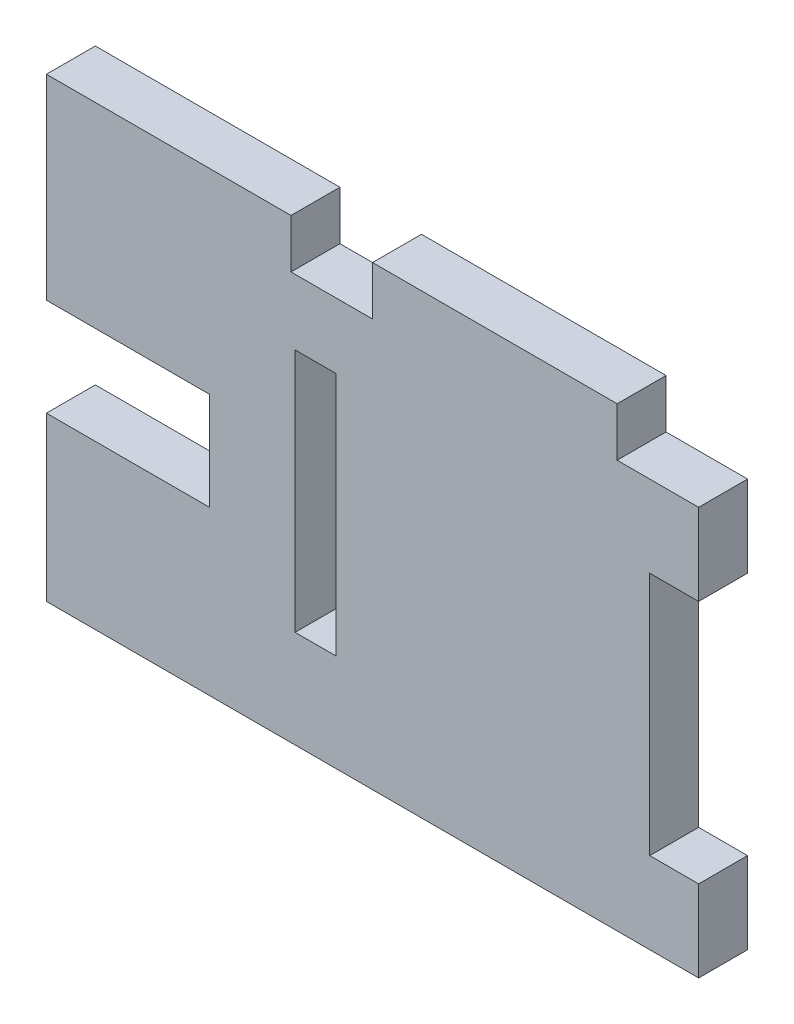
ISO-10303-21;
HEADER;
FILE_DESCRIPTION(('STEP AP214'),'2;1');
FILE_NAME('part.step','',(''),(''),'','','');
FILE_SCHEMA(('AUTOMOTIVE_DESIGN { 1 0 10303 214 1 1 1 1 }'));
ENDSEC;
DATA;
#1=APPLICATION_CONTEXT('core data for automotive mechanical design processes');
#2=APPLICATION_PROTOCOL_DEFINITION('international standard','automotive_design',2000,#1);
#3=PRODUCT_CONTEXT('',#1,'mechanical');
#4=PRODUCT('Part','Part','',(#3));
#5=PRODUCT_RELATED_PRODUCT_CATEGORY('part','',(#4));
#6=PRODUCT_DEFINITION_FORMATION('','',#4);
#7=PRODUCT_DEFINITION_CONTEXT('part definition',#1,'design');
#8=PRODUCT_DEFINITION('design','',#6,#7);
#9=PRODUCT_DEFINITION_SHAPE('','',#8);
#10=(LENGTH_UNIT() NAMED_UNIT(*) SI_UNIT(.MILLI.,.METRE.));
#11=(NAMED_UNIT(*) PLANE_ANGLE_UNIT() SI_UNIT($,.RADIAN.));
#12=(NAMED_UNIT(*) SI_UNIT($,.STERADIAN.) SOLID_ANGLE_UNIT());
#13=UNCERTAINTY_MEASURE_WITH_UNIT(LENGTH_MEASURE(1.E-05),#10,'distance_accuracy_value','');
#14=(GEOMETRIC_REPRESENTATION_CONTEXT(3) GLOBAL_UNCERTAINTY_ASSIGNED_CONTEXT((#13)) GLOBAL_UNIT_ASSIGNED_CONTEXT((#10,
#11,#12)) REPRESENTATION_CONTEXT('',''));
#15=CARTESIAN_POINT('',(0.,0.,0.));
#16=DIRECTION('',(0.,0.,1.));
#17=DIRECTION('',(1.,0.,0.));
#18=AXIS2_PLACEMENT_3D('',#15,#16,#17);
#19=CARTESIAN_POINT('',(-2.07380645161294,0.,3.));
#20=DIRECTION('',(-1.,0.,0.));
#21=DIRECTION('',(0.,0.,1.));
#22=AXIS2_PLACEMENT_3D('',#19,#20,#21);
#23=PLANE('',#22);
#24=DIRECTION('',(0.,1.,0.));
#25=VECTOR('',#24,1.);
#26=CARTESIAN_POINT('',(-2.07380645161294,0.,0.));
#27=LINE('',#26,#25);
#28=CARTESIAN_POINT('',(-2.07380645161294,7.86290322580648,0.));
#29=VERTEX_POINT('',#28);
#30=CARTESIAN_POINT('',(-2.07380645161294,10.8629032258065,0.));
#31=VERTEX_POINT('',#30);
#32=EDGE_CURVE('E237',#29,#31,#27,.T.);
#33=ORIENTED_EDGE('',*,*,#32,.F.);
#34=DIRECTION('',(0.,0.,-1.));
#35=VECTOR('',#34,1.);
#36=CARTESIAN_POINT('',(-2.07380645161294,7.86290322580648,3.));
#37=LINE('',#36,#35);
#38=CARTESIAN_POINT('',(-2.07380645161294,7.86290322580648,3.));
#39=VERTEX_POINT('',#38);
#40=EDGE_CURVE('E11',#39,#29,#37,.T.);
#41=ORIENTED_EDGE('',*,*,#40,.F.);
#42=DIRECTION('',(0.,1.,0.));
#43=VECTOR('',#42,1.);
#44=CARTESIAN_POINT('',(-2.07380645161294,0.,3.));
#45=LINE('',#44,#43);
#46=CARTESIAN_POINT('',(-2.07380645161294,10.8629032258065,3.));
#47=VERTEX_POINT('',#46);
#48=EDGE_CURVE('E345',#39,#47,#45,.T.);
#49=ORIENTED_EDGE('',*,*,#48,.T.);
#50=DIRECTION('',(0.,0.,-1.));
#51=VECTOR('',#50,1.);
#52=CARTESIAN_POINT('',(-2.07380645161294,10.8629032258065,3.));
#53=LINE('',#52,#51);
#54=EDGE_CURVE('E62',#47,#31,#53,.T.);
#55=ORIENTED_EDGE('',*,*,#54,.T.);
#56=EDGE_LOOP('',(#33,#41,#49,#55));
#57=FACE_BOUND('',#56,.T.);
#58=ADVANCED_FACE('F36',(#57),#23,.T.);
#59=CARTESIAN_POINT('',(0.,7.86290322580648,3.));
#60=DIRECTION('',(0.,-1.,0.));
#61=DIRECTION('',(1.,0.,0.));
#62=AXIS2_PLACEMENT_3D('',#59,#60,#61);
#63=PLANE('',#62);
#64=DIRECTION('',(-1.,0.,0.));
#65=VECTOR('',#64,1.);
#66=CARTESIAN_POINT('',(0.,7.86290322580648,0.));
#67=LINE('',#66,#65);
#68=CARTESIAN_POINT('',(-7.07380645161294,7.86290322580648,0.));
#69=VERTEX_POINT('',#68);
#70=EDGE_CURVE('E239',#29,#69,#67,.T.);
#71=ORIENTED_EDGE('',*,*,#70,.T.);
#72=DIRECTION('',(0.,0.,-1.));
#73=VECTOR('',#72,1.);
#74=CARTESIAN_POINT('',(-7.07380645161294,7.86290322580648,3.));
#75=LINE('',#74,#73);
#76=CARTESIAN_POINT('',(-7.07380645161294,7.86290322580648,3.));
#77=VERTEX_POINT('',#76);
#78=EDGE_CURVE('E45',#77,#69,#75,.T.);
#79=ORIENTED_EDGE('',*,*,#78,.F.);
#80=DIRECTION('',(-1.,0.,0.));
#81=VECTOR('',#80,1.);
#82=CARTESIAN_POINT('',(0.,7.86290322580648,3.));
#83=LINE('',#82,#81);
#84=EDGE_CURVE('E347',#39,#77,#83,.T.);
#85=ORIENTED_EDGE('',*,*,#84,.F.);
#86=ORIENTED_EDGE('',*,*,#40,.T.);
#87=EDGE_LOOP('',(#71,#79,#85,#86));
#88=FACE_BOUND('',#87,.T.);
#89=ADVANCED_FACE('F382',(#88),#63,.F.);
#90=CARTESIAN_POINT('',(-7.07380645161294,0.,3.));
#91=DIRECTION('',(1.,0.,0.));
#92=DIRECTION('',(0.,0.,-1.));
#93=AXIS2_PLACEMENT_3D('',#90,#91,#92);
#94=PLANE('',#93);
#95=DIRECTION('',(0.,-1.,0.));
#96=VECTOR('',#95,1.);
#97=CARTESIAN_POINT('',(-7.07380645161294,0.,0.));
#98=LINE('',#97,#96);
#99=CARTESIAN_POINT('',(-7.07380645161294,10.8629032258065,0.));
#100=VERTEX_POINT('',#99);
#101=EDGE_CURVE('E242',#100,#69,#98,.T.);
#102=ORIENTED_EDGE('',*,*,#101,.F.);
#103=DIRECTION('',(0.,0.,-1.));
#104=VECTOR('',#103,1.);
#105=CARTESIAN_POINT('',(-7.07380645161294,10.8629032258065,3.));
#106=LINE('',#105,#104);
#107=CARTESIAN_POINT('',(-7.07380645161294,10.8629032258065,3.));
#108=VERTEX_POINT('',#107);
#109=EDGE_CURVE('E289',#108,#100,#106,.T.);
#110=ORIENTED_EDGE('',*,*,#109,.F.);
#111=DIRECTION('',(0.,-1.,0.));
#112=VECTOR('',#111,1.);
#113=CARTESIAN_POINT('',(-7.07380645161294,0.,3.));
#114=LINE('',#113,#112);
#115=EDGE_CURVE('E349',#108,#77,#114,.T.);
#116=ORIENTED_EDGE('',*,*,#115,.T.);
#117=ORIENTED_EDGE('',*,*,#78,.T.);
#118=EDGE_LOOP('',(#102,#110,#116,#117));
#119=FACE_BOUND('',#118,.T.);
#120=ADVANCED_FACE('F385',(#119),#94,.T.);
#121=CARTESIAN_POINT('',(0.,10.8629032258065,3.));
#122=DIRECTION('',(0.,1.,0.));
#123=DIRECTION('',(0.,0.,1.));
#124=AXIS2_PLACEMENT_3D('',#121,#122,#123);
#125=PLANE('',#124);
#126=DIRECTION('',(1.,0.,0.));
#127=VECTOR('',#126,1.);
#128=CARTESIAN_POINT('',(0.,10.8629032258065,0.));
#129=LINE('',#128,#127);
#130=CARTESIAN_POINT('',(-22.0738064516129,10.8629032258065,0.));
#131=VERTEX_POINT('',#130);
#132=EDGE_CURVE('E245',#131,#100,#129,.T.);
#133=ORIENTED_EDGE('',*,*,#132,.F.);
#134=DIRECTION('',(0.,0.,-1.));
#135=VECTOR('',#134,1.);
#136=CARTESIAN_POINT('',(-22.0738064516129,10.8629032258065,3.));
#137=LINE('',#136,#135);
#138=CARTESIAN_POINT('',(-22.0738064516129,10.8629032258065,3.));
#139=VERTEX_POINT('',#138);
#140=EDGE_CURVE('E287',#139,#131,#137,.T.);
#141=ORIENTED_EDGE('',*,*,#140,.F.);
#142=DIRECTION('',(1.,0.,0.));
#143=VECTOR('',#142,1.);
#144=CARTESIAN_POINT('',(0.,10.8629032258065,3.));
#145=LINE('',#144,#143);
#146=EDGE_CURVE('E352',#139,#108,#145,.T.);
#147=ORIENTED_EDGE('',*,*,#146,.T.);
#148=ORIENTED_EDGE('',*,*,#109,.T.);
#149=EDGE_LOOP('',(#133,#141,#147,#148));
#150=FACE_BOUND('',#149,.T.);
#151=ADVANCED_FACE('F389',(#150),#125,.T.);
#152=CARTESIAN_POINT('',(-22.0738064516129,0.,3.));
#153=DIRECTION('',(-1.,0.,0.));
#154=DIRECTION('',(0.,0.,1.));
#155=AXIS2_PLACEMENT_3D('',#152,#153,#154);
#156=PLANE('',#155);
#157=DIRECTION('',(0.,1.,0.));
#158=VECTOR('',#157,1.);
#159=CARTESIAN_POINT('',(-22.0738064516129,0.,0.));
#160=LINE('',#159,#158);
#161=CARTESIAN_POINT('',(-22.0738064516129,-1.13709677419353,0.));
#162=VERTEX_POINT('',#161);
#163=EDGE_CURVE('E248',#162,#131,#160,.T.);
#164=ORIENTED_EDGE('',*,*,#163,.F.);
#165=DIRECTION('',(0.,0.,-1.));
#166=VECTOR('',#165,1.);
#167=CARTESIAN_POINT('',(-22.0738064516129,-1.13709677419353,3.));
#168=LINE('',#167,#166);
#169=CARTESIAN_POINT('',(-22.0738064516129,-1.13709677419353,3.));
#170=VERTEX_POINT('',#169);
#171=EDGE_CURVE('E220',#170,#162,#168,.T.);
#172=ORIENTED_EDGE('',*,*,#171,.F.);
#173=DIRECTION('',(0.,1.,0.));
#174=VECTOR('',#173,1.);
#175=CARTESIAN_POINT('',(-22.0738064516129,0.,3.));
#176=LINE('',#175,#174);
#177=EDGE_CURVE('E355',#170,#139,#176,.T.);
#178=ORIENTED_EDGE('',*,*,#177,.T.);
#179=ORIENTED_EDGE('',*,*,#140,.T.);
#180=EDGE_LOOP('',(#164,#172,#178,#179));
#181=FACE_BOUND('',#180,.T.);
#182=ADVANCED_FACE('F392',(#181),#156,.T.);
#183=CARTESIAN_POINT('',(0.,-17.1370967741935,3.));
#184=DIRECTION('',(0.,-1.,0.));
#185=DIRECTION('',(1.,0.,0.));
#186=AXIS2_PLACEMENT_3D('',#183,#184,#185);
#187=PLANE('',#186);
#188=DIRECTION('',(0.,0.,1.));
#189=VECTOR('',#188,1.);
#190=CARTESIAN_POINT('',(-22.0738064516129,-17.1370967741935,0.));
#191=LINE('',#190,#189);
#192=CARTESIAN_POINT('',(-22.0738064516129,-17.1370967741935,0.));
#193=VERTEX_POINT('',#192);
#194=CARTESIAN_POINT('',(-22.0738064516129,-17.1370967741935,3.));
#195=VERTEX_POINT('',#194);
#196=EDGE_CURVE('E324',#193,#195,#191,.T.);
#197=ORIENTED_EDGE('',*,*,#196,.F.);
#198=DIRECTION('',(-1.,0.,0.));
#199=VECTOR('',#198,1.);
#200=CARTESIAN_POINT('',(0.,-17.1370967741935,0.));
#201=LINE('',#200,#199);
#202=CARTESIAN_POINT('',(17.9261935483871,-17.1370967741935,0.));
#203=VERTEX_POINT('',#202);
#204=EDGE_CURVE('E251',#203,#193,#201,.T.);
#205=ORIENTED_EDGE('',*,*,#204,.F.);
#206=DIRECTION('',(0.,0.,-1.));
#207=VECTOR('',#206,1.);
#208=CARTESIAN_POINT('',(17.9261935483871,-17.1370967741935,3.));
#209=LINE('',#208,#207);
#210=CARTESIAN_POINT('',(17.9261935483871,-17.1370967741935,3.));
#211=VERTEX_POINT('',#210);
#212=EDGE_CURVE('E285',#211,#203,#209,.T.);
#213=ORIENTED_EDGE('',*,*,#212,.F.);
#214=DIRECTION('',(-1.,0.,0.));
#215=VECTOR('',#214,1.);
#216=CARTESIAN_POINT('',(0.,-17.1370967741935,3.));
#217=LINE('',#216,#215);
#218=EDGE_CURVE('E358',#211,#195,#217,.T.);
#219=ORIENTED_EDGE('',*,*,#218,.T.);
#220=EDGE_LOOP('',(#197,#205,#213,#219));
#221=FACE_BOUND('',#220,.T.);
#222=ADVANCED_FACE('F401',(#221),#187,.T.);
#223=CARTESIAN_POINT('',(17.9261935483871,0.,3.));
#224=DIRECTION('',(1.,0.,0.));
#225=DIRECTION('',(0.,0.,-1.));
#226=AXIS2_PLACEMENT_3D('',#223,#224,#225);
#227=PLANE('',#226);
#228=DIRECTION('',(0.,-1.,0.));
#229=VECTOR('',#228,1.);
#230=CARTESIAN_POINT('',(17.9261935483871,0.,0.));
#231=LINE('',#230,#229);
#232=CARTESIAN_POINT('',(17.9261935483871,-12.1370967741935,0.));
#233=VERTEX_POINT('',#232);
#234=EDGE_CURVE('E254',#233,#203,#231,.T.);
#235=ORIENTED_EDGE('',*,*,#234,.F.);
#236=DIRECTION('',(0.,0.,-1.));
#237=VECTOR('',#236,1.);
#238=CARTESIAN_POINT('',(17.9261935483871,-12.1370967741935,3.));
#239=LINE('',#238,#237);
#240=CARTESIAN_POINT('',(17.9261935483871,-12.1370967741935,3.));
#241=VERTEX_POINT('',#240);
#242=EDGE_CURVE('E283',#241,#233,#239,.T.);
#243=ORIENTED_EDGE('',*,*,#242,.F.);
#244=DIRECTION('',(0.,-1.,0.));
#245=VECTOR('',#244,1.);
#246=CARTESIAN_POINT('',(17.9261935483871,0.,3.));
#247=LINE('',#246,#245);
#248=EDGE_CURVE('E360',#241,#211,#247,.T.);
#249=ORIENTED_EDGE('',*,*,#248,.T.);
#250=ORIENTED_EDGE('',*,*,#212,.T.);
#251=EDGE_LOOP('',(#235,#243,#249,#250));
#252=FACE_BOUND('',#251,.T.);
#253=ADVANCED_FACE('F406',(#252),#227,.T.);
#254=CARTESIAN_POINT('',(0.,-12.1370967741935,3.));
#255=DIRECTION('',(0.,-1.,0.));
#256=DIRECTION('',(1.,0.,0.));
#257=AXIS2_PLACEMENT_3D('',#254,#255,#256);
#258=PLANE('',#257);
#259=DIRECTION('',(-1.,0.,0.));
#260=VECTOR('',#259,1.);
#261=CARTESIAN_POINT('',(0.,-12.1370967741935,0.));
#262=LINE('',#261,#260);
#263=CARTESIAN_POINT('',(14.9261935483871,-12.1370967741935,0.));
#264=VERTEX_POINT('',#263);
#265=EDGE_CURVE('E257',#233,#264,#262,.T.);
#266=ORIENTED_EDGE('',*,*,#265,.T.);
#267=DIRECTION('',(0.,0.,-1.));
#268=VECTOR('',#267,1.);
#269=CARTESIAN_POINT('',(14.9261935483871,-12.1370967741935,3.));
#270=LINE('',#269,#268);
#271=CARTESIAN_POINT('',(14.9261935483871,-12.1370967741935,3.));
#272=VERTEX_POINT('',#271);
#273=EDGE_CURVE('E281',#272,#264,#270,.T.);
#274=ORIENTED_EDGE('',*,*,#273,.F.);
#275=DIRECTION('',(-1.,0.,0.));
#276=VECTOR('',#275,1.);
#277=CARTESIAN_POINT('',(0.,-12.1370967741935,3.));
#278=LINE('',#277,#276);
#279=EDGE_CURVE('E363',#241,#272,#278,.T.);
#280=ORIENTED_EDGE('',*,*,#279,.F.);
#281=ORIENTED_EDGE('',*,*,#242,.T.);
#282=EDGE_LOOP('',(#266,#274,#280,#281));
#283=FACE_BOUND('',#282,.T.);
#284=ADVANCED_FACE('F412',(#283),#258,.F.);
#285=CARTESIAN_POINT('',(14.9261935483871,0.,3.));
#286=DIRECTION('',(1.,0.,0.));
#287=DIRECTION('',(0.,1.,0.));
#288=AXIS2_PLACEMENT_3D('',#285,#286,#287);
#289=PLANE('',#288);
#290=DIRECTION('',(0.,-1.,0.));
#291=VECTOR('',#290,1.);
#292=CARTESIAN_POINT('',(14.9261935483871,0.,0.));
#293=LINE('',#292,#291);
#294=CARTESIAN_POINT('',(14.9261935483871,2.86290322580648,0.));
#295=VERTEX_POINT('',#294);
#296=EDGE_CURVE('E261',#295,#264,#293,.T.);
#297=ORIENTED_EDGE('',*,*,#296,.F.);
#298=DIRECTION('',(0.,0.,-1.));
#299=VECTOR('',#298,1.);
#300=CARTESIAN_POINT('',(14.9261935483871,2.86290322580648,3.));
#301=LINE('',#300,#299);
#302=CARTESIAN_POINT('',(14.9261935483871,2.86290322580648,3.));
#303=VERTEX_POINT('',#302);
#304=EDGE_CURVE('E279',#303,#295,#301,.T.);
#305=ORIENTED_EDGE('',*,*,#304,.F.);
#306=DIRECTION('',(0.,-1.,0.));
#307=VECTOR('',#306,1.);
#308=CARTESIAN_POINT('',(14.9261935483871,0.,3.));
#309=LINE('',#308,#307);
#310=EDGE_CURVE('E365',#303,#272,#309,.T.);
#311=ORIENTED_EDGE('',*,*,#310,.T.);
#312=ORIENTED_EDGE('',*,*,#273,.T.);
#313=EDGE_LOOP('',(#297,#305,#311,#312));
#314=FACE_BOUND('',#313,.T.);
#315=ADVANCED_FACE('F415',(#314),#289,.T.);
#316=CARTESIAN_POINT('',(0.,2.86290322580648,3.));
#317=DIRECTION('',(0.,-1.,0.));
#318=DIRECTION('',(1.,0.,0.));
#319=AXIS2_PLACEMENT_3D('',#316,#317,#318);
#320=PLANE('',#319);
#321=DIRECTION('',(-1.,0.,0.));
#322=VECTOR('',#321,1.);
#323=CARTESIAN_POINT('',(0.,2.86290322580648,0.));
#324=LINE('',#323,#322);
#325=CARTESIAN_POINT('',(17.9261935483871,2.86290322580648,0.));
#326=VERTEX_POINT('',#325);
#327=EDGE_CURVE('E264',#326,#295,#324,.T.);
#328=ORIENTED_EDGE('',*,*,#327,.F.);
#329=DIRECTION('',(0.,0.,-1.));
#330=VECTOR('',#329,1.);
#331=CARTESIAN_POINT('',(17.9261935483871,2.86290322580648,3.));
#332=LINE('',#331,#330);
#333=CARTESIAN_POINT('',(17.9261935483871,2.86290322580648,3.));
#334=VERTEX_POINT('',#333);
#335=EDGE_CURVE('E277',#334,#326,#332,.T.);
#336=ORIENTED_EDGE('',*,*,#335,.F.);
#337=DIRECTION('',(-1.,0.,0.));
#338=VECTOR('',#337,1.);
#339=CARTESIAN_POINT('',(0.,2.86290322580648,3.));
#340=LINE('',#339,#338);
#341=EDGE_CURVE('E367',#334,#303,#340,.T.);
#342=ORIENTED_EDGE('',*,*,#341,.T.);
#343=ORIENTED_EDGE('',*,*,#304,.T.);
#344=EDGE_LOOP('',(#328,#336,#342,#343));
#345=FACE_BOUND('',#344,.T.);
#346=ADVANCED_FACE('F416',(#345),#320,.T.);
#347=CARTESIAN_POINT('',(17.9261935483871,7.86290322580648,0.));
#348=VERTEX_POINT('',#347);
#349=EDGE_CURVE('E258',#348,#326,#231,.T.);
#350=ORIENTED_EDGE('',*,*,#349,.F.);
#351=DIRECTION('',(0.,0.,-1.));
#352=VECTOR('',#351,1.);
#353=CARTESIAN_POINT('',(17.9261935483871,7.86290322580648,3.));
#354=LINE('',#353,#352);
#355=CARTESIAN_POINT('',(17.9261935483871,7.86290322580648,3.));
#356=VERTEX_POINT('',#355);
#357=EDGE_CURVE('E207',#356,#348,#354,.T.);
#358=ORIENTED_EDGE('',*,*,#357,.F.);
#359=EDGE_CURVE('E196',#356,#334,#247,.T.);
#360=ORIENTED_EDGE('',*,*,#359,.T.);
#361=ORIENTED_EDGE('',*,*,#335,.T.);
#362=EDGE_LOOP('',(#350,#358,#360,#361));
#363=FACE_BOUND('',#362,.T.);
#364=ADVANCED_FACE('F372',(#363),#227,.T.);
#365=CARTESIAN_POINT('',(0.,7.86290322580648,3.));
#366=DIRECTION('',(0.,-1.,0.));
#367=DIRECTION('',(0.,0.,-1.));
#368=AXIS2_PLACEMENT_3D('',#365,#366,#367);
#369=PLANE('',#368);
#370=DIRECTION('',(-1.,0.,0.));
#371=VECTOR('',#370,1.);
#372=CARTESIAN_POINT('',(0.,7.86290322580648,0.));
#373=LINE('',#372,#371);
#374=CARTESIAN_POINT('',(12.9261935483871,7.86290322580648,0.));
#375=VERTEX_POINT('',#374);
#376=EDGE_CURVE('E203',#348,#375,#373,.T.);
#377=ORIENTED_EDGE('',*,*,#376,.T.);
#378=DIRECTION('',(0.,0.,-1.));
#379=VECTOR('',#378,1.);
#380=CARTESIAN_POINT('',(12.9261935483871,7.86290322580648,3.));
#381=LINE('',#380,#379);
#382=CARTESIAN_POINT('',(12.9261935483871,7.86290322580648,3.));
#383=VERTEX_POINT('',#382);
#384=EDGE_CURVE('E200',#383,#375,#381,.T.);
#385=ORIENTED_EDGE('',*,*,#384,.F.);
#386=DIRECTION('',(-1.,0.,0.));
#387=VECTOR('',#386,1.);
#388=CARTESIAN_POINT('',(0.,7.86290322580648,3.));
#389=LINE('',#388,#387);
#390=EDGE_CURVE('E186',#356,#383,#389,.T.);
#391=ORIENTED_EDGE('',*,*,#390,.F.);
#392=ORIENTED_EDGE('',*,*,#357,.T.);
#393=EDGE_LOOP('',(#377,#385,#391,#392));
#394=FACE_BOUND('',#393,.T.);
#395=ADVANCED_FACE('F201',(#394),#369,.F.);
#396=CARTESIAN_POINT('',(12.9261935483871,0.,3.));
#397=DIRECTION('',(1.,0.,0.));
#398=DIRECTION('',(0.,1.,0.));
#399=AXIS2_PLACEMENT_3D('',#396,#397,#398);
#400=PLANE('',#399);
#401=DIRECTION('',(0.,-1.,0.));
#402=VECTOR('',#401,1.);
#403=CARTESIAN_POINT('',(12.9261935483871,0.,0.));
#404=LINE('',#403,#402);
#405=CARTESIAN_POINT('',(12.9261935483871,10.8629032258065,0.));
#406=VERTEX_POINT('',#405);
#407=EDGE_CURVE('E268',#406,#375,#404,.T.);
#408=ORIENTED_EDGE('',*,*,#407,.F.);
#409=DIRECTION('',(0.,0.,-1.));
#410=VECTOR('',#409,1.);
#411=CARTESIAN_POINT('',(12.9261935483871,10.8629032258065,3.));
#412=LINE('',#411,#410);
#413=CARTESIAN_POINT('',(12.9261935483871,10.8629032258065,3.));
#414=VERTEX_POINT('',#413);
#415=EDGE_CURVE('E208',#414,#406,#412,.T.);
#416=ORIENTED_EDGE('',*,*,#415,.F.);
#417=DIRECTION('',(0.,-1.,0.));
#418=VECTOR('',#417,1.);
#419=CARTESIAN_POINT('',(12.9261935483871,0.,3.));
#420=LINE('',#419,#418);
#421=EDGE_CURVE('E193',#414,#383,#420,.T.);
#422=ORIENTED_EDGE('',*,*,#421,.T.);
#423=ORIENTED_EDGE('',*,*,#384,.T.);
#424=EDGE_LOOP('',(#408,#416,#422,#423));
#425=FACE_BOUND('',#424,.T.);
#426=ADVANCED_FACE('F210',(#425),#400,.T.);
#427=CARTESIAN_POINT('',(0.,-11.1532258064516,3.));
#428=DIRECTION('',(0.,-1.,0.));
#429=DIRECTION('',(1.,0.,0.));
#430=AXIS2_PLACEMENT_3D('',#427,#428,#429);
#431=PLANE('',#430);
#432=DIRECTION('',(-1.,0.,0.));
#433=VECTOR('',#432,1.);
#434=CARTESIAN_POINT('',(0.,-11.1532258064516,0.));
#435=LINE('',#434,#433);
#436=CARTESIAN_POINT('',(-4.32380645161294,-11.1532258064516,0.));
#437=VERTEX_POINT('',#436);
#438=CARTESIAN_POINT('',(-6.82380645161294,-11.1532258064516,0.));
#439=VERTEX_POINT('',#438);
#440=EDGE_CURVE('E225',#437,#439,#435,.T.);
#441=ORIENTED_EDGE('',*,*,#440,.T.);
#442=DIRECTION('',(0.,0.,-1.));
#443=VECTOR('',#442,1.);
#444=CARTESIAN_POINT('',(-6.82380645161294,-11.1532258064516,3.));
#445=LINE('',#444,#443);
#446=CARTESIAN_POINT('',(-6.82380645161294,-11.1532258064516,3.));
#447=VERTEX_POINT('',#446);
#448=EDGE_CURVE('E274',#447,#439,#445,.T.);
#449=ORIENTED_EDGE('',*,*,#448,.F.);
#450=DIRECTION('',(-1.,0.,0.));
#451=VECTOR('',#450,1.);
#452=CARTESIAN_POINT('',(0.,-11.1532258064516,3.));
#453=LINE('',#452,#451);
#454=CARTESIAN_POINT('',(-4.32380645161294,-11.1532258064516,3.));
#455=VERTEX_POINT('',#454);
#456=EDGE_CURVE('E330',#455,#447,#453,.T.);
#457=ORIENTED_EDGE('',*,*,#456,.F.);
#458=DIRECTION('',(0.,0.,-1.));
#459=VECTOR('',#458,1.);
#460=CARTESIAN_POINT('',(-4.32380645161294,-11.1532258064516,3.));
#461=LINE('',#460,#459);
#462=EDGE_CURVE('E292',#455,#437,#461,.T.);
#463=ORIENTED_EDGE('',*,*,#462,.T.);
#464=EDGE_LOOP('',(#441,#449,#457,#463));
#465=FACE_BOUND('',#464,.T.);
#466=ADVANCED_FACE('F444',(#465),#431,.F.);
#467=CARTESIAN_POINT('',(-6.82380645161294,0.,3.));
#468=DIRECTION('',(-1.,0.,0.));
#469=DIRECTION('',(0.,0.,1.));
#470=AXIS2_PLACEMENT_3D('',#467,#468,#469);
#471=PLANE('',#470);
#472=DIRECTION('',(0.,1.,0.));
#473=VECTOR('',#472,1.);
#474=CARTESIAN_POINT('',(-6.82380645161294,0.,0.));
#475=LINE('',#474,#473);
#476=CARTESIAN_POINT('',(-6.82380645161294,3.8467741935484,0.));
#477=VERTEX_POINT('',#476);
#478=EDGE_CURVE('E228',#439,#477,#475,.T.);
#479=ORIENTED_EDGE('',*,*,#478,.T.);
#480=DIRECTION('',(0.,0.,-1.));
#481=VECTOR('',#480,1.);
#482=CARTESIAN_POINT('',(-6.82380645161294,3.8467741935484,3.));
#483=LINE('',#482,#481);
#484=CARTESIAN_POINT('',(-6.82380645161294,3.8467741935484,3.));
#485=VERTEX_POINT('',#484);
#486=EDGE_CURVE('E296',#485,#477,#483,.T.);
#487=ORIENTED_EDGE('',*,*,#486,.F.);
#488=DIRECTION('',(0.,1.,0.));
#489=VECTOR('',#488,1.);
#490=CARTESIAN_POINT('',(-6.82380645161294,0.,3.));
#491=LINE('',#490,#489);
#492=EDGE_CURVE('E333',#447,#485,#491,.T.);
#493=ORIENTED_EDGE('',*,*,#492,.F.);
#494=ORIENTED_EDGE('',*,*,#448,.T.);
#495=EDGE_LOOP('',(#479,#487,#493,#494));
#496=FACE_BOUND('',#495,.T.);
#497=ADVANCED_FACE('F440',(#496),#471,.F.);
#498=CARTESIAN_POINT('',(0.,3.8467741935484,3.));
#499=DIRECTION('',(0.,-1.,0.));
#500=DIRECTION('',(1.,0.,0.));
#501=AXIS2_PLACEMENT_3D('',#498,#499,#500);
#502=PLANE('',#501);
#503=DIRECTION('',(-1.,0.,0.));
#504=VECTOR('',#503,1.);
#505=CARTESIAN_POINT('',(0.,3.8467741935484,0.));
#506=LINE('',#505,#504);
#507=CARTESIAN_POINT('',(-4.32380645161294,3.8467741935484,0.));
#508=VERTEX_POINT('',#507);
#509=EDGE_CURVE('E231',#508,#477,#506,.T.);
#510=ORIENTED_EDGE('',*,*,#509,.F.);
#511=DIRECTION('',(0.,0.,-1.));
#512=VECTOR('',#511,1.);
#513=CARTESIAN_POINT('',(-4.32380645161294,3.8467741935484,3.));
#514=LINE('',#513,#512);
#515=CARTESIAN_POINT('',(-4.32380645161294,3.8467741935484,3.));
#516=VERTEX_POINT('',#515);
#517=EDGE_CURVE('E294',#516,#508,#514,.T.);
#518=ORIENTED_EDGE('',*,*,#517,.F.);
#519=DIRECTION('',(-1.,0.,0.));
#520=VECTOR('',#519,1.);
#521=CARTESIAN_POINT('',(0.,3.8467741935484,3.));
#522=LINE('',#521,#520);
#523=EDGE_CURVE('E339',#516,#485,#522,.T.);
#524=ORIENTED_EDGE('',*,*,#523,.T.);
#525=ORIENTED_EDGE('',*,*,#486,.T.);
#526=EDGE_LOOP('',(#510,#518,#524,#525));
#527=FACE_BOUND('',#526,.T.);
#528=ADVANCED_FACE('F437',(#527),#502,.T.);
#529=CARTESIAN_POINT('',(0.,-1.13709677419353,3.));
#530=DIRECTION('',(0.,1.,0.));
#531=DIRECTION('',(-1.,0.,0.));
#532=AXIS2_PLACEMENT_3D('',#529,#530,#531);
#533=PLANE('',#532);
#534=DIRECTION('',(1.,0.,0.));
#535=VECTOR('',#534,1.);
#536=CARTESIAN_POINT('',(0.,-1.13709677419353,3.));
#537=LINE('',#536,#535);
#538=CARTESIAN_POINT('',(-12.0738064516129,-1.13709677419353,3.));
#539=VERTEX_POINT('',#538);
#540=EDGE_CURVE('E134',#170,#539,#537,.T.);
#541=ORIENTED_EDGE('',*,*,#540,.F.);
#542=ORIENTED_EDGE('',*,*,#171,.T.);
#543=DIRECTION('',(1.,0.,0.));
#544=VECTOR('',#543,1.);
#545=CARTESIAN_POINT('',(0.,-1.13709677419353,0.));
#546=LINE('',#545,#544);
#547=CARTESIAN_POINT('',(-12.0738064516129,-1.13709677419353,0.));
#548=VERTEX_POINT('',#547);
#549=EDGE_CURVE('E217',#162,#548,#546,.T.);
#550=ORIENTED_EDGE('',*,*,#549,.T.);
#551=DIRECTION('',(0.,0.,-1.));
#552=VECTOR('',#551,1.);
#553=CARTESIAN_POINT('',(-12.0738064516129,-1.13709677419353,3.));
#554=LINE('',#553,#552);
#555=EDGE_CURVE('E40',#539,#548,#554,.T.);
#556=ORIENTED_EDGE('',*,*,#555,.F.);
#557=EDGE_LOOP('',(#541,#542,#550,#556));
#558=FACE_BOUND('',#557,.T.);
#559=ADVANCED_FACE('F38',(#558),#533,.F.);
#560=CARTESIAN_POINT('',(-12.0738064516129,0.,3.));
#561=DIRECTION('',(1.,0.,0.));
#562=DIRECTION('',(0.,0.,-1.));
#563=AXIS2_PLACEMENT_3D('',#560,#561,#562);
#564=PLANE('',#563);
#565=DIRECTION('',(0.,-1.,0.));
#566=VECTOR('',#565,1.);
#567=CARTESIAN_POINT('',(-12.0738064516129,0.,0.));
#568=LINE('',#567,#566);
#569=CARTESIAN_POINT('',(-12.0738064516129,-7.13709677419353,0.));
#570=VERTEX_POINT('',#569);
#571=EDGE_CURVE('E219',#548,#570,#568,.T.);
#572=ORIENTED_EDGE('',*,*,#571,.T.);
#573=DIRECTION('',(0.,0.,-1.));
#574=VECTOR('',#573,1.);
#575=CARTESIAN_POINT('',(-12.0738064516129,-7.13709677419353,3.));
#576=LINE('',#575,#574);
#577=CARTESIAN_POINT('',(-12.0738064516129,-7.13709677419353,3.));
#578=VERTEX_POINT('',#577);
#579=EDGE_CURVE('E213',#578,#570,#576,.T.);
#580=ORIENTED_EDGE('',*,*,#579,.F.);
#581=DIRECTION('',(0.,-1.,0.));
#582=VECTOR('',#581,1.);
#583=CARTESIAN_POINT('',(-12.0738064516129,0.,3.));
#584=LINE('',#583,#582);
#585=EDGE_CURVE('E308',#539,#578,#584,.T.);
#586=ORIENTED_EDGE('',*,*,#585,.F.);
#587=ORIENTED_EDGE('',*,*,#555,.T.);
#588=EDGE_LOOP('',(#572,#580,#586,#587));
#589=FACE_BOUND('',#588,.T.);
#590=ADVANCED_FACE('F306',(#589),#564,.F.);
#591=CARTESIAN_POINT('',(0.,-7.13709677419353,3.));
#592=DIRECTION('',(0.,1.,0.));
#593=DIRECTION('',(0.,0.,1.));
#594=AXIS2_PLACEMENT_3D('',#591,#592,#593);
#595=PLANE('',#594);
#596=DIRECTION('',(0.,0.,-1.));
#597=VECTOR('',#596,1.);
#598=CARTESIAN_POINT('',(-22.0738064516129,-7.13709677419353,3.));
#599=LINE('',#598,#597);
#600=CARTESIAN_POINT('',(-22.0738064516129,-7.13709677419353,3.));
#601=VERTEX_POINT('',#600);
#602=CARTESIAN_POINT('',(-22.0738064516129,-7.13709677419353,0.));
#603=VERTEX_POINT('',#602);
#604=EDGE_CURVE('E53',#601,#603,#599,.T.);
#605=ORIENTED_EDGE('',*,*,#604,.F.);
#606=DIRECTION('',(1.,0.,0.));
#607=VECTOR('',#606,1.);
#608=CARTESIAN_POINT('',(0.,-7.13709677419353,3.));
#609=LINE('',#608,#607);
#610=EDGE_CURVE('E321',#601,#578,#609,.T.);
#611=ORIENTED_EDGE('',*,*,#610,.T.);
#612=ORIENTED_EDGE('',*,*,#579,.T.);
#613=DIRECTION('',(1.,0.,0.));
#614=VECTOR('',#613,1.);
#615=CARTESIAN_POINT('',(0.,-7.13709677419353,0.));
#616=LINE('',#615,#614);
#617=EDGE_CURVE('E223',#603,#570,#616,.T.);
#618=ORIENTED_EDGE('',*,*,#617,.F.);
#619=EDGE_LOOP('',(#605,#611,#612,#618));
#620=FACE_BOUND('',#619,.T.);
#621=ADVANCED_FACE('F318',(#620),#595,.T.);
#622=CARTESIAN_POINT('',(-4.32380645161294,0.,3.));
#623=DIRECTION('',(-1.,0.,0.));
#624=DIRECTION('',(0.,0.,1.));
#625=AXIS2_PLACEMENT_3D('',#622,#623,#624);
#626=PLANE('',#625);
#627=DIRECTION('',(0.,1.,0.));
#628=VECTOR('',#627,1.);
#629=CARTESIAN_POINT('',(-4.32380645161294,0.,0.));
#630=LINE('',#629,#628);
#631=EDGE_CURVE('E234',#437,#508,#630,.T.);
#632=ORIENTED_EDGE('',*,*,#631,.F.);
#633=ORIENTED_EDGE('',*,*,#462,.F.);
#634=DIRECTION('',(0.,1.,0.));
#635=VECTOR('',#634,1.);
#636=CARTESIAN_POINT('',(-4.32380645161294,0.,3.));
#637=LINE('',#636,#635);
#638=EDGE_CURVE('E342',#455,#516,#637,.T.);
#639=ORIENTED_EDGE('',*,*,#638,.T.);
#640=ORIENTED_EDGE('',*,*,#517,.T.);
#641=EDGE_LOOP('',(#632,#633,#639,#640));
#642=FACE_BOUND('',#641,.T.);
#643=ADVANCED_FACE('F433',(#642),#626,.T.);
#644=CARTESIAN_POINT('',(0.,10.8629032258065,3.));
#645=DIRECTION('',(0.,1.,0.));
#646=DIRECTION('',(0.,0.,1.));
#647=AXIS2_PLACEMENT_3D('',#644,#645,#646);
#648=PLANE('',#647);
#649=DIRECTION('',(1.,0.,0.));
#650=VECTOR('',#649,1.);
#651=CARTESIAN_POINT('',(0.,10.8629032258065,0.));
#652=LINE('',#651,#650);
#653=EDGE_CURVE('E270',#31,#406,#652,.T.);
#654=ORIENTED_EDGE('',*,*,#653,.F.);
#655=ORIENTED_EDGE('',*,*,#54,.F.);
#656=DIRECTION('',(1.,0.,0.));
#657=VECTOR('',#656,1.);
#658=CARTESIAN_POINT('',(0.,10.8629032258065,3.));
#659=LINE('',#658,#657);
#660=EDGE_CURVE('E211',#47,#414,#659,.T.);
#661=ORIENTED_EDGE('',*,*,#660,.T.);
#662=ORIENTED_EDGE('',*,*,#415,.T.);
#663=EDGE_LOOP('',(#654,#655,#661,#662));
#664=FACE_BOUND('',#663,.T.);
#665=ADVANCED_FACE('F376',(#664),#648,.T.);
#666=CARTESIAN_POINT('',(0.,0.,3.));
#667=DIRECTION('',(0.,0.,1.));
#668=DIRECTION('',(1.,0.,0.));
#669=AXIS2_PLACEMENT_3D('',#666,#667,#668);
#670=PLANE('',#669);
#671=DIRECTION('',(0.,1.,0.));
#672=VECTOR('',#671,1.);
#673=CARTESIAN_POINT('',(-22.0738064516129,1.86290322580649,3.));
#674=LINE('',#673,#672);
#675=EDGE_CURVE('E328',#195,#601,#674,.T.);
#676=ORIENTED_EDGE('',*,*,#675,.F.);
#677=ORIENTED_EDGE('',*,*,#218,.F.);
#678=ORIENTED_EDGE('',*,*,#248,.F.);
#679=ORIENTED_EDGE('',*,*,#279,.T.);
#680=ORIENTED_EDGE('',*,*,#310,.F.);
#681=ORIENTED_EDGE('',*,*,#341,.F.);
#682=ORIENTED_EDGE('',*,*,#359,.F.);
#683=ORIENTED_EDGE('',*,*,#390,.T.);
#684=ORIENTED_EDGE('',*,*,#421,.F.);
#685=ORIENTED_EDGE('',*,*,#660,.F.);
#686=ORIENTED_EDGE('',*,*,#48,.F.);
#687=ORIENTED_EDGE('',*,*,#84,.T.);
#688=ORIENTED_EDGE('',*,*,#115,.F.);
#689=ORIENTED_EDGE('',*,*,#146,.F.);
#690=ORIENTED_EDGE('',*,*,#177,.F.);
#691=ORIENTED_EDGE('',*,*,#540,.T.);
#692=ORIENTED_EDGE('',*,*,#585,.T.);
#693=ORIENTED_EDGE('',*,*,#610,.F.);
#694=EDGE_LOOP('',(#676,#677,#678,#679,#680,#681,#682,#683,#684,#685,#686,#687,#688,#689,#690,
#691,#692,#693));
#695=FACE_BOUND('',#694,.T.);
#696=ORIENTED_EDGE('',*,*,#456,.T.);
#697=ORIENTED_EDGE('',*,*,#492,.T.);
#698=ORIENTED_EDGE('',*,*,#523,.F.);
#699=ORIENTED_EDGE('',*,*,#638,.F.);
#700=EDGE_LOOP('',(#696,#697,#698,#699));
#701=FACE_BOUND('',#700,.T.);
#702=ADVANCED_FACE('F189',(#695,#701),#670,.T.);
#703=CARTESIAN_POINT('',(0.,0.,0.));
#704=DIRECTION('',(0.,0.,1.));
#705=DIRECTION('',(1.,0.,0.));
#706=AXIS2_PLACEMENT_3D('',#703,#704,#705);
#707=PLANE('',#706);
#708=ORIENTED_EDGE('',*,*,#204,.T.);
#709=DIRECTION('',(0.,1.,0.));
#710=VECTOR('',#709,1.);
#711=CARTESIAN_POINT('',(-22.0738064516129,-17.1370967741935,0.));
#712=LINE('',#711,#710);
#713=EDGE_CURVE('E317',#193,#603,#712,.T.);
#714=ORIENTED_EDGE('',*,*,#713,.T.);
#715=ORIENTED_EDGE('',*,*,#617,.T.);
#716=ORIENTED_EDGE('',*,*,#571,.F.);
#717=ORIENTED_EDGE('',*,*,#549,.F.);
#718=ORIENTED_EDGE('',*,*,#163,.T.);
#719=ORIENTED_EDGE('',*,*,#132,.T.);
#720=ORIENTED_EDGE('',*,*,#101,.T.);
#721=ORIENTED_EDGE('',*,*,#70,.F.);
#722=ORIENTED_EDGE('',*,*,#32,.T.);
#723=ORIENTED_EDGE('',*,*,#653,.T.);
#724=ORIENTED_EDGE('',*,*,#407,.T.);
#725=ORIENTED_EDGE('',*,*,#376,.F.);
#726=ORIENTED_EDGE('',*,*,#349,.T.);
#727=ORIENTED_EDGE('',*,*,#327,.T.);
#728=ORIENTED_EDGE('',*,*,#296,.T.);
#729=ORIENTED_EDGE('',*,*,#265,.F.);
#730=ORIENTED_EDGE('',*,*,#234,.T.);
#731=EDGE_LOOP('',(#708,#714,#715,#716,#717,#718,#719,#720,#721,#722,#723,#724,#725,#726,#727,
#728,#729,#730));
#732=FACE_BOUND('',#731,.T.);
#733=ORIENTED_EDGE('',*,*,#440,.F.);
#734=ORIENTED_EDGE('',*,*,#631,.T.);
#735=ORIENTED_EDGE('',*,*,#509,.T.);
#736=ORIENTED_EDGE('',*,*,#478,.F.);
#737=EDGE_LOOP('',(#733,#734,#735,#736));
#738=FACE_BOUND('',#737,.T.);
#739=ADVANCED_FACE('F315',(#732,#738),#707,.F.);
#740=CARTESIAN_POINT('',(-22.0738064516129,1.86290322580649,0.));
#741=DIRECTION('',(1.,0.,0.));
#742=DIRECTION('',(0.,1.,0.));
#743=AXIS2_PLACEMENT_3D('',#740,#741,#742);
#744=PLANE('',#743);
#745=ORIENTED_EDGE('',*,*,#604,.T.);
#746=ORIENTED_EDGE('',*,*,#713,.F.);
#747=ORIENTED_EDGE('',*,*,#196,.T.);
#748=ORIENTED_EDGE('',*,*,#675,.T.);
#749=EDGE_LOOP('',(#745,#746,#747,#748));
#750=FACE_BOUND('',#749,.T.);
#751=ADVANCED_FACE('F397',(#750),#744,.F.);
#752=CLOSED_SHELL('',(#58,#89,#120,#151,#182,#222,#253,#284,#315,#346,#364,#395,#426,#466,#497,
#528,#559,#590,#621,#643,#665,#702,#739,#751));
#753=MANIFOLD_SOLID_BREP('B2',#752);
#754=ADVANCED_BREP_SHAPE_REPRESENTATION('',(#18,#753),#14);
#755=SHAPE_DEFINITION_REPRESENTATION(#9,#754);
ENDSEC;
END-ISO-10303-21;
